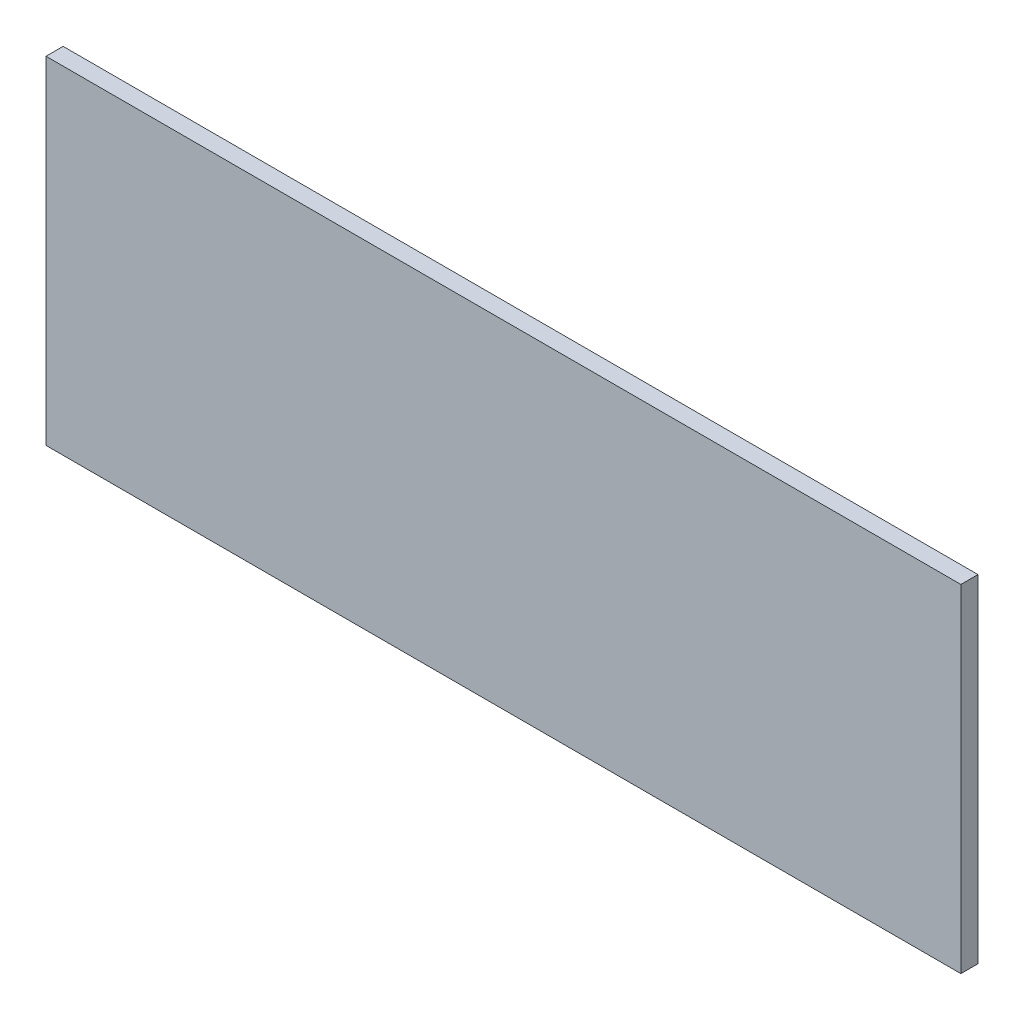
ISO-10303-21;
HEADER;
FILE_DESCRIPTION(('STEP AP214'),'2;1');
FILE_NAME('part.step','',(''),(''),'','','');
FILE_SCHEMA(('AUTOMOTIVE_DESIGN { 1 0 10303 214 1 1 1 1 }'));
ENDSEC;
DATA;
#1=APPLICATION_CONTEXT('core data for automotive mechanical design processes');
#2=APPLICATION_PROTOCOL_DEFINITION('international standard','automotive_design',2000,#1);
#3=PRODUCT_CONTEXT('',#1,'mechanical');
#4=PRODUCT('Part','Part','',(#3));
#5=PRODUCT_RELATED_PRODUCT_CATEGORY('part','',(#4));
#6=PRODUCT_DEFINITION_FORMATION('','',#4);
#7=PRODUCT_DEFINITION_CONTEXT('part definition',#1,'design');
#8=PRODUCT_DEFINITION('design','',#6,#7);
#9=PRODUCT_DEFINITION_SHAPE('','',#8);
#10=(LENGTH_UNIT() NAMED_UNIT(*) SI_UNIT(.MILLI.,.METRE.));
#11=(NAMED_UNIT(*) PLANE_ANGLE_UNIT() SI_UNIT($,.RADIAN.));
#12=(NAMED_UNIT(*) SI_UNIT($,.STERADIAN.) SOLID_ANGLE_UNIT());
#13=UNCERTAINTY_MEASURE_WITH_UNIT(LENGTH_MEASURE(1.E-05),#10,'distance_accuracy_value','');
#14=(GEOMETRIC_REPRESENTATION_CONTEXT(3) GLOBAL_UNCERTAINTY_ASSIGNED_CONTEXT((#13)) GLOBAL_UNIT_ASSIGNED_CONTEXT((#10,
#11,#12)) REPRESENTATION_CONTEXT('',''));
#15=CARTESIAN_POINT('',(0.,0.,0.));
#16=DIRECTION('',(0.,0.,1.));
#17=DIRECTION('',(1.,0.,0.));
#18=AXIS2_PLACEMENT_3D('',#15,#16,#17);
#19=CARTESIAN_POINT('',(96.5670013427734,70.0869979858398,0.));
#20=DIRECTION('',(0.,1.,0.));
#21=DIRECTION('',(1.,0.,0.));
#22=AXIS2_PLACEMENT_3D('',#19,#20,#21);
#23=PLANE('',#22);
#24=DIRECTION('',(1.,0.,0.));
#25=VECTOR('',#24,1.);
#26=CARTESIAN_POINT('',(96.5670013427734,70.0869979858398,0.03556));
#27=LINE('',#26,#25);
#28=CARTESIAN_POINT('',(96.5670013427734,70.0869979858398,0.03556));
#29=VERTEX_POINT('',#28);
#30=CARTESIAN_POINT('',(98.4670028686523,70.0869979858398,0.03556));
#31=VERTEX_POINT('',#30);
#32=EDGE_CURVE('E11',#29,#31,#27,.T.);
#33=ORIENTED_EDGE('',*,*,#32,.F.);
#34=DIRECTION('',(0.,0.,1.));
#35=VECTOR('',#34,1.);
#36=CARTESIAN_POINT('',(96.5670013427734,70.0869979858398,0.));
#37=LINE('',#36,#35);
#38=CARTESIAN_POINT('',(96.5670013427734,70.0869979858398,0.));
#39=VERTEX_POINT('',#38);
#40=EDGE_CURVE('E24',#39,#29,#37,.T.);
#41=ORIENTED_EDGE('',*,*,#40,.F.);
#42=DIRECTION('',(1.,0.,0.));
#43=VECTOR('',#42,1.);
#44=CARTESIAN_POINT('',(96.5670013427734,70.0869979858398,0.));
#45=LINE('',#44,#43);
#46=CARTESIAN_POINT('',(98.4670028686523,70.0869979858398,0.));
#47=VERTEX_POINT('',#46);
#48=EDGE_CURVE('E75',#39,#47,#45,.T.);
#49=ORIENTED_EDGE('',*,*,#48,.T.);
#50=DIRECTION('',(0.,0.,1.));
#51=VECTOR('',#50,1.);
#52=CARTESIAN_POINT('',(98.4670028686523,70.0869979858398,0.));
#53=LINE('',#52,#51);
#54=EDGE_CURVE('E37',#47,#31,#53,.T.);
#55=ORIENTED_EDGE('',*,*,#54,.T.);
#56=EDGE_LOOP('',(#33,#41,#49,#55));
#57=FACE_BOUND('',#56,.T.);
#58=ADVANCED_FACE('F17',(#57),#23,.F.);
#59=CARTESIAN_POINT('',(98.4670028686523,70.0869979858398,0.));
#60=DIRECTION('',(-1.,0.,0.));
#61=DIRECTION('',(0.,1.,0.));
#62=AXIS2_PLACEMENT_3D('',#59,#60,#61);
#63=PLANE('',#62);
#64=DIRECTION('',(0.,1.,0.));
#65=VECTOR('',#64,1.);
#66=CARTESIAN_POINT('',(98.4670028686523,70.0869979858398,0.03556));
#67=LINE('',#66,#65);
#68=CARTESIAN_POINT('',(98.4670028686523,70.7870025634766,0.03556));
#69=VERTEX_POINT('',#68);
#70=EDGE_CURVE('E83',#31,#69,#67,.T.);
#71=ORIENTED_EDGE('',*,*,#70,.F.);
#72=ORIENTED_EDGE('',*,*,#54,.F.);
#73=DIRECTION('',(0.,1.,0.));
#74=VECTOR('',#73,1.);
#75=CARTESIAN_POINT('',(98.4670028686523,70.0869979858398,0.));
#76=LINE('',#75,#74);
#77=CARTESIAN_POINT('',(98.4670028686523,70.7870025634766,0.));
#78=VERTEX_POINT('',#77);
#79=EDGE_CURVE('E81',#47,#78,#76,.T.);
#80=ORIENTED_EDGE('',*,*,#79,.T.);
#81=DIRECTION('',(0.,0.,1.));
#82=VECTOR('',#81,1.);
#83=CARTESIAN_POINT('',(98.4670028686523,70.7870025634766,0.));
#84=LINE('',#83,#82);
#85=EDGE_CURVE('E67',#78,#69,#84,.T.);
#86=ORIENTED_EDGE('',*,*,#85,.T.);
#87=EDGE_LOOP('',(#71,#72,#80,#86));
#88=FACE_BOUND('',#87,.T.);
#89=ADVANCED_FACE('F89',(#88),#63,.F.);
#90=CARTESIAN_POINT('',(98.4670028686523,70.7870025634766,0.));
#91=DIRECTION('',(0.,-1.,0.));
#92=DIRECTION('',(-1.,0.,0.));
#93=AXIS2_PLACEMENT_3D('',#90,#91,#92);
#94=PLANE('',#93);
#95=DIRECTION('',(-1.,0.,0.));
#96=VECTOR('',#95,1.);
#97=CARTESIAN_POINT('',(98.4670028686523,70.7870025634766,0.03556));
#98=LINE('',#97,#96);
#99=CARTESIAN_POINT('',(96.5670013427734,70.7870025634766,0.03556));
#100=VERTEX_POINT('',#99);
#101=EDGE_CURVE('E71',#69,#100,#98,.T.);
#102=ORIENTED_EDGE('',*,*,#101,.F.);
#103=ORIENTED_EDGE('',*,*,#85,.F.);
#104=DIRECTION('',(-1.,0.,0.));
#105=VECTOR('',#104,1.);
#106=CARTESIAN_POINT('',(98.4670028686523,70.7870025634766,0.));
#107=LINE('',#106,#105);
#108=CARTESIAN_POINT('',(96.5670013427734,70.7870025634766,0.));
#109=VERTEX_POINT('',#108);
#110=EDGE_CURVE('E63',#78,#109,#107,.T.);
#111=ORIENTED_EDGE('',*,*,#110,.T.);
#112=DIRECTION('',(0.,0.,1.));
#113=VECTOR('',#112,1.);
#114=CARTESIAN_POINT('',(96.5670013427734,70.7870025634766,0.));
#115=LINE('',#114,#113);
#116=EDGE_CURVE('E53',#109,#100,#115,.T.);
#117=ORIENTED_EDGE('',*,*,#116,.T.);
#118=EDGE_LOOP('',(#102,#103,#111,#117));
#119=FACE_BOUND('',#118,.T.);
#120=ADVANCED_FACE('F66',(#119),#94,.F.);
#121=CARTESIAN_POINT('',(96.5670013427734,70.7870025634766,0.));
#122=DIRECTION('',(1.,0.,0.));
#123=DIRECTION('',(0.,-1.,0.));
#124=AXIS2_PLACEMENT_3D('',#121,#122,#123);
#125=PLANE('',#124);
#126=DIRECTION('',(0.,-1.,0.));
#127=VECTOR('',#126,1.);
#128=CARTESIAN_POINT('',(96.5670013427734,70.7870025634766,0.03556));
#129=LINE('',#128,#127);
#130=EDGE_CURVE('E59',#100,#29,#129,.T.);
#131=ORIENTED_EDGE('',*,*,#130,.F.);
#132=ORIENTED_EDGE('',*,*,#116,.F.);
#133=DIRECTION('',(0.,-1.,0.));
#134=VECTOR('',#133,1.);
#135=CARTESIAN_POINT('',(96.5670013427734,70.7870025634766,0.));
#136=LINE('',#135,#134);
#137=EDGE_CURVE('E57',#109,#39,#136,.T.);
#138=ORIENTED_EDGE('',*,*,#137,.T.);
#139=ORIENTED_EDGE('',*,*,#40,.T.);
#140=EDGE_LOOP('',(#131,#132,#138,#139));
#141=FACE_BOUND('',#140,.T.);
#142=ADVANCED_FACE('F55',(#141),#125,.F.);
#143=CARTESIAN_POINT('',(96.5670013427734,70.0869979858398,0.));
#144=DIRECTION('',(0.,0.,-1.));
#145=DIRECTION('',(-1.,0.,0.));
#146=AXIS2_PLACEMENT_3D('',#143,#144,#145);
#147=PLANE('',#146);
#148=ORIENTED_EDGE('',*,*,#137,.F.);
#149=ORIENTED_EDGE('',*,*,#110,.F.);
#150=ORIENTED_EDGE('',*,*,#79,.F.);
#151=ORIENTED_EDGE('',*,*,#48,.F.);
#152=EDGE_LOOP('',(#148,#149,#150,#151));
#153=FACE_BOUND('',#152,.T.);
#154=ADVANCED_FACE('F74',(#153),#147,.T.);
#155=CARTESIAN_POINT('',(96.5670013427734,70.0869979858398,0.03556));
#156=DIRECTION('',(0.,0.,-1.));
#157=DIRECTION('',(-1.,0.,0.));
#158=AXIS2_PLACEMENT_3D('',#155,#156,#157);
#159=PLANE('',#158);
#160=ORIENTED_EDGE('',*,*,#32,.T.);
#161=ORIENTED_EDGE('',*,*,#70,.T.);
#162=ORIENTED_EDGE('',*,*,#101,.T.);
#163=ORIENTED_EDGE('',*,*,#130,.T.);
#164=EDGE_LOOP('',(#160,#161,#162,#163));
#165=FACE_BOUND('',#164,.T.);
#166=ADVANCED_FACE('F91',(#165),#159,.F.);
#167=CLOSED_SHELL('',(#58,#89,#120,#142,#154,#166));
#168=MANIFOLD_SOLID_BREP('B1',#167);
#169=ADVANCED_BREP_SHAPE_REPRESENTATION('',(#18,#168),#14);
#170=SHAPE_DEFINITION_REPRESENTATION(#9,#169);
ENDSEC;
END-ISO-10303-21;
